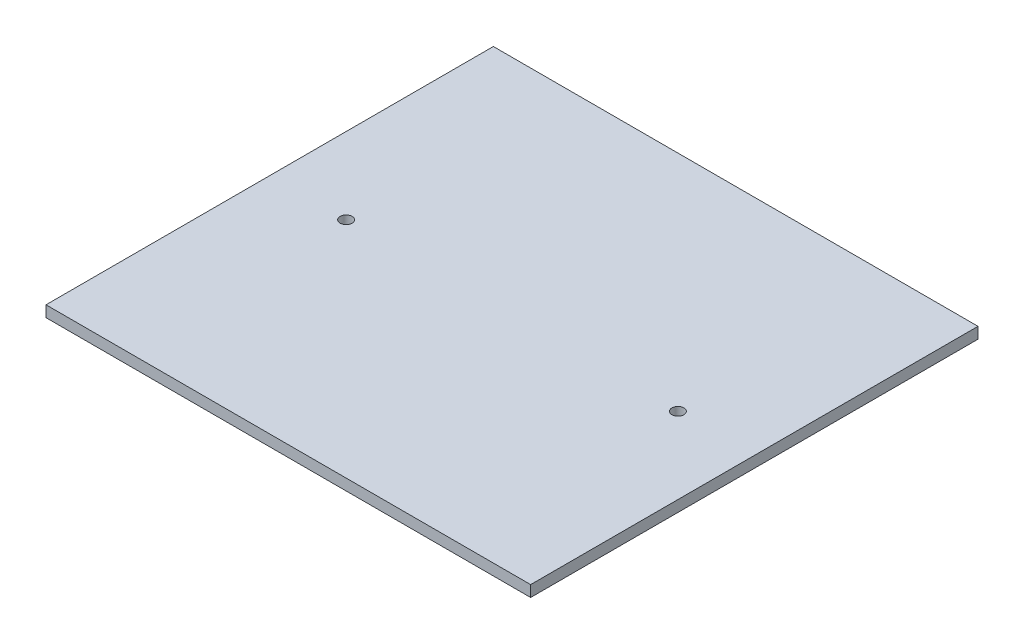
ISO-10303-21;
HEADER;
FILE_DESCRIPTION(('STEP AP214'),'2;1');
FILE_NAME('part.step','',(''),(''),'','','');
FILE_SCHEMA(('AUTOMOTIVE_DESIGN { 1 0 10303 214 1 1 1 1 }'));
ENDSEC;
DATA;
#1=APPLICATION_CONTEXT('core data for automotive mechanical design processes');
#2=APPLICATION_PROTOCOL_DEFINITION('international standard','automotive_design',2000,#1);
#3=PRODUCT_CONTEXT('',#1,'mechanical');
#4=PRODUCT('Part','Part','',(#3));
#5=PRODUCT_RELATED_PRODUCT_CATEGORY('part','',(#4));
#6=PRODUCT_DEFINITION_FORMATION('','',#4);
#7=PRODUCT_DEFINITION_CONTEXT('part definition',#1,'design');
#8=PRODUCT_DEFINITION('design','',#6,#7);
#9=PRODUCT_DEFINITION_SHAPE('','',#8);
#10=(LENGTH_UNIT() NAMED_UNIT(*) SI_UNIT(.MILLI.,.METRE.));
#11=(NAMED_UNIT(*) PLANE_ANGLE_UNIT() SI_UNIT($,.RADIAN.));
#12=(NAMED_UNIT(*) SI_UNIT($,.STERADIAN.) SOLID_ANGLE_UNIT());
#13=UNCERTAINTY_MEASURE_WITH_UNIT(LENGTH_MEASURE(1.E-05),#10,'distance_accuracy_value','');
#14=(GEOMETRIC_REPRESENTATION_CONTEXT(3) GLOBAL_UNCERTAINTY_ASSIGNED_CONTEXT((#13)) GLOBAL_UNIT_ASSIGNED_CONTEXT((#10,
#11,#12)) REPRESENTATION_CONTEXT('',''));
#15=CARTESIAN_POINT('',(0.,0.,0.));
#16=DIRECTION('',(0.,0.,1.));
#17=DIRECTION('',(1.,0.,0.));
#18=AXIS2_PLACEMENT_3D('',#15,#16,#17);
#19=CARTESIAN_POINT('',(65.,3.,60.));
#20=DIRECTION('',(-1.,0.,0.));
#21=DIRECTION('',(0.,0.,1.));
#22=AXIS2_PLACEMENT_3D('',#19,#20,#21);
#23=PLANE('',#22);
#24=DIRECTION('',(0.,0.,-1.));
#25=VECTOR('',#24,1.);
#26=CARTESIAN_POINT('',(65.,0.,60.));
#27=LINE('',#26,#25);
#28=CARTESIAN_POINT('',(65.,0.,60.));
#29=VERTEX_POINT('',#28);
#30=CARTESIAN_POINT('',(65.,0.,-60.));
#31=VERTEX_POINT('',#30);
#32=EDGE_CURVE('E96',#29,#31,#27,.T.);
#33=ORIENTED_EDGE('',*,*,#32,.T.);
#34=DIRECTION('',(0.,-1.,0.));
#35=VECTOR('',#34,1.);
#36=CARTESIAN_POINT('',(65.,3.,-60.));
#37=LINE('',#36,#35);
#38=CARTESIAN_POINT('',(65.,3.,-60.));
#39=VERTEX_POINT('',#38);
#40=EDGE_CURVE('E11',#39,#31,#37,.T.);
#41=ORIENTED_EDGE('',*,*,#40,.F.);
#42=DIRECTION('',(0.,0.,-1.));
#43=VECTOR('',#42,1.);
#44=CARTESIAN_POINT('',(65.,3.,60.));
#45=LINE('',#44,#43);
#46=CARTESIAN_POINT('',(65.,3.,60.));
#47=VERTEX_POINT('',#46);
#48=EDGE_CURVE('E84',#47,#39,#45,.T.);
#49=ORIENTED_EDGE('',*,*,#48,.F.);
#50=DIRECTION('',(0.,-1.,0.));
#51=VECTOR('',#50,1.);
#52=CARTESIAN_POINT('',(65.,3.,60.));
#53=LINE('',#52,#51);
#54=EDGE_CURVE('E92',#47,#29,#53,.T.);
#55=ORIENTED_EDGE('',*,*,#54,.T.);
#56=EDGE_LOOP('',(#33,#41,#49,#55));
#57=FACE_BOUND('',#56,.T.);
#58=ADVANCED_FACE('F33',(#57),#23,.F.);
#59=CARTESIAN_POINT('',(-65.,3.,-60.));
#60=DIRECTION('',(0.,0.,1.));
#61=DIRECTION('',(1.,0.,0.));
#62=AXIS2_PLACEMENT_3D('',#59,#60,#61);
#63=PLANE('',#62);
#64=DIRECTION('',(-1.,0.,0.));
#65=VECTOR('',#64,1.);
#66=CARTESIAN_POINT('',(-65.,0.,-60.));
#67=LINE('',#66,#65);
#68=CARTESIAN_POINT('',(-65.,0.,-60.));
#69=VERTEX_POINT('',#68);
#70=EDGE_CURVE('E88',#31,#69,#67,.T.);
#71=ORIENTED_EDGE('',*,*,#70,.T.);
#72=DIRECTION('',(0.,-1.,0.));
#73=VECTOR('',#72,1.);
#74=CARTESIAN_POINT('',(-65.,3.,-60.));
#75=LINE('',#74,#73);
#76=CARTESIAN_POINT('',(-65.,3.,-60.));
#77=VERTEX_POINT('',#76);
#78=EDGE_CURVE('E41',#77,#69,#75,.T.);
#79=ORIENTED_EDGE('',*,*,#78,.F.);
#80=DIRECTION('',(-1.,0.,0.));
#81=VECTOR('',#80,1.);
#82=CARTESIAN_POINT('',(-65.,3.,-60.));
#83=LINE('',#82,#81);
#84=EDGE_CURVE('E79',#39,#77,#83,.T.);
#85=ORIENTED_EDGE('',*,*,#84,.F.);
#86=ORIENTED_EDGE('',*,*,#40,.T.);
#87=EDGE_LOOP('',(#71,#79,#85,#86));
#88=FACE_BOUND('',#87,.T.);
#89=ADVANCED_FACE('F87',(#88),#63,.F.);
#90=CARTESIAN_POINT('',(-65.,3.,60.));
#91=DIRECTION('',(1.,0.,0.));
#92=DIRECTION('',(0.,0.,-1.));
#93=AXIS2_PLACEMENT_3D('',#90,#91,#92);
#94=PLANE('',#93);
#95=DIRECTION('',(0.,0.,1.));
#96=VECTOR('',#95,1.);
#97=CARTESIAN_POINT('',(-65.,0.,60.));
#98=LINE('',#97,#96);
#99=CARTESIAN_POINT('',(-65.,0.,60.));
#100=VERTEX_POINT('',#99);
#101=EDGE_CURVE('E66',#69,#100,#98,.T.);
#102=ORIENTED_EDGE('',*,*,#101,.T.);
#103=DIRECTION('',(0.,-1.,0.));
#104=VECTOR('',#103,1.);
#105=CARTESIAN_POINT('',(-65.,3.,60.));
#106=LINE('',#105,#104);
#107=CARTESIAN_POINT('',(-65.,3.,60.));
#108=VERTEX_POINT('',#107);
#109=EDGE_CURVE('E89',#108,#100,#106,.T.);
#110=ORIENTED_EDGE('',*,*,#109,.F.);
#111=DIRECTION('',(0.,0.,1.));
#112=VECTOR('',#111,1.);
#113=CARTESIAN_POINT('',(-65.,3.,60.));
#114=LINE('',#113,#112);
#115=EDGE_CURVE('E82',#77,#108,#114,.T.);
#116=ORIENTED_EDGE('',*,*,#115,.F.);
#117=ORIENTED_EDGE('',*,*,#78,.T.);
#118=EDGE_LOOP('',(#102,#110,#116,#117));
#119=FACE_BOUND('',#118,.T.);
#120=ADVANCED_FACE('F90',(#119),#94,.F.);
#121=CARTESIAN_POINT('',(-65.,3.,60.));
#122=DIRECTION('',(0.,0.,-1.));
#123=DIRECTION('',(-1.,0.,0.));
#124=AXIS2_PLACEMENT_3D('',#121,#122,#123);
#125=PLANE('',#124);
#126=DIRECTION('',(1.,0.,0.));
#127=VECTOR('',#126,1.);
#128=CARTESIAN_POINT('',(-65.,0.,60.));
#129=LINE('',#128,#127);
#130=EDGE_CURVE('E72',#100,#29,#129,.T.);
#131=ORIENTED_EDGE('',*,*,#130,.T.);
#132=ORIENTED_EDGE('',*,*,#54,.F.);
#133=DIRECTION('',(1.,0.,0.));
#134=VECTOR('',#133,1.);
#135=CARTESIAN_POINT('',(-65.,3.,60.));
#136=LINE('',#135,#134);
#137=EDGE_CURVE('E49',#108,#47,#136,.T.);
#138=ORIENTED_EDGE('',*,*,#137,.F.);
#139=ORIENTED_EDGE('',*,*,#109,.T.);
#140=EDGE_LOOP('',(#131,#132,#138,#139));
#141=FACE_BOUND('',#140,.T.);
#142=ADVANCED_FACE('F104',(#141),#125,.F.);
#143=CARTESIAN_POINT('',(0.,3.,0.));
#144=DIRECTION('',(0.,-1.,0.));
#145=DIRECTION('',(0.,0.,-1.));
#146=AXIS2_PLACEMENT_3D('',#143,#144,#145);
#147=PLANE('',#146);
#148=CARTESIAN_POINT('',(-44.5,3.,0.));
#149=DIRECTION('',(0.,-1.,0.));
#150=DIRECTION('',(0.,0.,-1.));
#151=AXIS2_PLACEMENT_3D('',#148,#149,#150);
#152=CIRCLE('',#151,1.6);
#153=CARTESIAN_POINT('',(-44.5,3.,-1.6));
#154=VERTEX_POINT('',#153);
#155=EDGE_CURVE('E115',#154,#154,#152,.F.);
#156=ORIENTED_EDGE('',*,*,#155,.F.);
#157=EDGE_LOOP('',(#156));
#158=FACE_BOUND('',#157,.T.);
#159=CARTESIAN_POINT('',(44.5,3.,0.));
#160=DIRECTION('',(0.,-1.,0.));
#161=DIRECTION('',(0.,0.,-1.));
#162=AXIS2_PLACEMENT_3D('',#159,#160,#161);
#163=CIRCLE('',#162,1.6);
#164=CARTESIAN_POINT('',(44.5,3.,-1.6));
#165=VERTEX_POINT('',#164);
#166=EDGE_CURVE('E99',#165,#165,#163,.T.);
#167=ORIENTED_EDGE('',*,*,#166,.T.);
#168=EDGE_LOOP('',(#167));
#169=FACE_BOUND('',#168,.T.);
#170=ORIENTED_EDGE('',*,*,#48,.T.);
#171=ORIENTED_EDGE('',*,*,#84,.T.);
#172=ORIENTED_EDGE('',*,*,#115,.T.);
#173=ORIENTED_EDGE('',*,*,#137,.T.);
#174=EDGE_LOOP('',(#170,#171,#172,#173));
#175=FACE_BOUND('',#174,.T.);
#176=ADVANCED_FACE('F80',(#158,#169,#175),#147,.F.);
#177=CARTESIAN_POINT('',(0.,0.,0.));
#178=DIRECTION('',(0.,-1.,0.));
#179=DIRECTION('',(0.,0.,-1.));
#180=AXIS2_PLACEMENT_3D('',#177,#178,#179);
#181=PLANE('',#180);
#182=CARTESIAN_POINT('',(-44.5,0.,0.));
#183=DIRECTION('',(0.,-1.,0.));
#184=DIRECTION('',(0.,0.,1.));
#185=AXIS2_PLACEMENT_3D('',#182,#183,#184);
#186=CIRCLE('',#185,1.6);
#187=CARTESIAN_POINT('',(-44.5,0.,1.6));
#188=VERTEX_POINT('',#187);
#189=EDGE_CURVE('E118',#188,#188,#186,.T.);
#190=ORIENTED_EDGE('',*,*,#189,.F.);
#191=EDGE_LOOP('',(#190));
#192=FACE_BOUND('',#191,.T.);
#193=CARTESIAN_POINT('',(44.5,0.,0.));
#194=DIRECTION('',(0.,1.,0.));
#195=DIRECTION('',(0.,0.,1.));
#196=AXIS2_PLACEMENT_3D('',#193,#194,#195);
#197=CIRCLE('',#196,1.6);
#198=CARTESIAN_POINT('',(44.5,0.,1.6));
#199=VERTEX_POINT('',#198);
#200=EDGE_CURVE('E112',#199,#199,#197,.T.);
#201=ORIENTED_EDGE('',*,*,#200,.T.);
#202=EDGE_LOOP('',(#201));
#203=FACE_BOUND('',#202,.T.);
#204=ORIENTED_EDGE('',*,*,#32,.F.);
#205=ORIENTED_EDGE('',*,*,#130,.F.);
#206=ORIENTED_EDGE('',*,*,#101,.F.);
#207=ORIENTED_EDGE('',*,*,#70,.F.);
#208=EDGE_LOOP('',(#204,#205,#206,#207));
#209=FACE_BOUND('',#208,.T.);
#210=ADVANCED_FACE('F107',(#192,#203,#209),#181,.T.);
#211=CARTESIAN_POINT('',(44.5,0.,0.));
#212=DIRECTION('',(0.,1.,0.));
#213=DIRECTION('',(0.,0.,1.));
#214=AXIS2_PLACEMENT_3D('',#211,#212,#213);
#215=CYLINDRICAL_SURFACE('',#214,1.6);
#216=ORIENTED_EDGE('',*,*,#200,.F.);
#217=EDGE_LOOP('',(#216));
#218=FACE_BOUND('',#217,.T.);
#219=ORIENTED_EDGE('',*,*,#166,.F.);
#220=EDGE_LOOP('',(#219));
#221=FACE_BOUND('',#220,.T.);
#222=ADVANCED_FACE('F127',(#218,#221),#215,.F.);
#223=CARTESIAN_POINT('',(-44.5,0.,0.));
#224=DIRECTION('',(0.,1.,0.));
#225=DIRECTION('',(0.,0.,1.));
#226=AXIS2_PLACEMENT_3D('',#223,#224,#225);
#227=CYLINDRICAL_SURFACE('',#226,1.6);
#228=ORIENTED_EDGE('',*,*,#189,.T.);
#229=EDGE_LOOP('',(#228));
#230=FACE_BOUND('',#229,.T.);
#231=ORIENTED_EDGE('',*,*,#155,.T.);
#232=EDGE_LOOP('',(#231));
#233=FACE_BOUND('',#232,.T.);
#234=ADVANCED_FACE('F122',(#230,#233),#227,.F.);
#235=CLOSED_SHELL('',(#58,#89,#120,#142,#176,#210,#222,#234));
#236=MANIFOLD_SOLID_BREP('B2',#235);
#237=ADVANCED_BREP_SHAPE_REPRESENTATION('',(#18,#236),#14);
#238=SHAPE_DEFINITION_REPRESENTATION(#9,#237);
ENDSEC;
END-ISO-10303-21;
